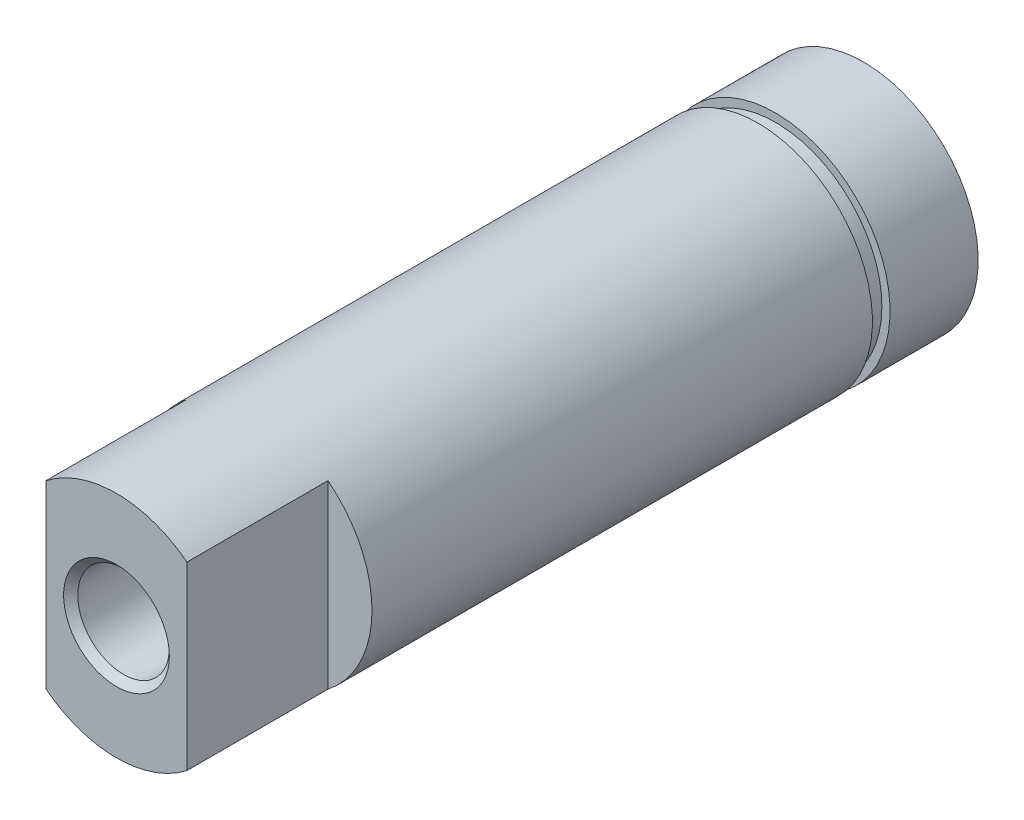
ISO-10303-21;
HEADER;
FILE_DESCRIPTION(('STEP AP214'),'2;1');
FILE_NAME('part.step','',(''),(''),'','','');
FILE_SCHEMA(('AUTOMOTIVE_DESIGN { 1 0 10303 214 1 1 1 1 }'));
ENDSEC;
DATA;
#1=APPLICATION_CONTEXT('core data for automotive mechanical design processes');
#2=APPLICATION_PROTOCOL_DEFINITION('international standard','automotive_design',2000,#1);
#3=PRODUCT_CONTEXT('',#1,'mechanical');
#4=PRODUCT('Part','Part','',(#3));
#5=PRODUCT_RELATED_PRODUCT_CATEGORY('part','',(#4));
#6=PRODUCT_DEFINITION_FORMATION('','',#4);
#7=PRODUCT_DEFINITION_CONTEXT('part definition',#1,'design');
#8=PRODUCT_DEFINITION('design','',#6,#7);
#9=PRODUCT_DEFINITION_SHAPE('','',#8);
#10=(LENGTH_UNIT() NAMED_UNIT(*) SI_UNIT(.MILLI.,.METRE.));
#11=(NAMED_UNIT(*) PLANE_ANGLE_UNIT() SI_UNIT($,.RADIAN.));
#12=(NAMED_UNIT(*) SI_UNIT($,.STERADIAN.) SOLID_ANGLE_UNIT());
#13=UNCERTAINTY_MEASURE_WITH_UNIT(LENGTH_MEASURE(1.E-05),#10,'distance_accuracy_value','');
#14=(GEOMETRIC_REPRESENTATION_CONTEXT(3) GLOBAL_UNCERTAINTY_ASSIGNED_CONTEXT((#13)) GLOBAL_UNIT_ASSIGNED_CONTEXT((#10,
#11,#12)) REPRESENTATION_CONTEXT('',''));
#15=CARTESIAN_POINT('',(0.,0.,0.));
#16=DIRECTION('',(0.,0.,1.));
#17=DIRECTION('',(1.,0.,0.));
#18=AXIS2_PLACEMENT_3D('',#15,#16,#17);
#19=CARTESIAN_POINT('',(0.,0.,6.2));
#20=DIRECTION('',(0.,0.,1.));
#21=DIRECTION('',(1.,0.,0.));
#22=AXIS2_PLACEMENT_3D('',#19,#20,#21);
#23=PLANE('',#22);
#24=CARTESIAN_POINT('',(0.,0.,6.2));
#25=DIRECTION('',(0.,0.,1.));
#26=DIRECTION('',(1.,0.,0.));
#27=AXIS2_PLACEMENT_3D('',#24,#25,#26);
#28=CIRCLE('',#27,1.3);
#29=CARTESIAN_POINT('',(1.3,0.,6.2));
#30=VERTEX_POINT('',#29);
#31=EDGE_CURVE('E19',#30,#30,#28,.F.);
#32=ORIENTED_EDGE('',*,*,#31,.F.);
#33=EDGE_LOOP('',(#32));
#34=FACE_BOUND('',#33,.T.);
#35=ADVANCED_FACE('F16',(#34),#23,.T.);
#36=CARTESIAN_POINT('',(0.,0.,6.2));
#37=DIRECTION('',(0.,0.,1.));
#38=DIRECTION('',(1.,0.,0.));
#39=AXIS2_PLACEMENT_3D('',#36,#37,#38);
#40=CYLINDRICAL_SURFACE('',#39,1.3);
#41=ORIENTED_EDGE('',*,*,#31,.T.);
#42=EDGE_LOOP('',(#41));
#43=FACE_BOUND('',#42,.T.);
#44=CARTESIAN_POINT('',(0.,0.,21.));
#45=DIRECTION('',(0.,0.,1.));
#46=DIRECTION('',(1.,0.,0.));
#47=AXIS2_PLACEMENT_3D('',#44,#45,#46);
#48=CIRCLE('',#47,1.3);
#49=CARTESIAN_POINT('',(1.3,0.,21.));
#50=VERTEX_POINT('',#49);
#51=EDGE_CURVE('E93',#50,#50,#48,.F.);
#52=ORIENTED_EDGE('',*,*,#51,.F.);
#53=EDGE_LOOP('',(#52));
#54=FACE_BOUND('',#53,.T.);
#55=ADVANCED_FACE('F232',(#43,#54),#40,.F.);
#56=CARTESIAN_POINT('',(0.,0.,21.));
#57=DIRECTION('',(0.,0.,1.));
#58=DIRECTION('',(1.,0.,0.));
#59=AXIS2_PLACEMENT_3D('',#56,#57,#58);
#60=CONICAL_SURFACE('',#59,1.3,0.785398163397451);
#61=ORIENTED_EDGE('',*,*,#51,.T.);
#62=EDGE_LOOP('',(#61));
#63=FACE_BOUND('',#62,.T.);
#64=CARTESIAN_POINT('',(0.,0.,21.2));
#65=DIRECTION('',(0.,0.,1.));
#66=DIRECTION('',(1.,0.,0.));
#67=AXIS2_PLACEMENT_3D('',#64,#65,#66);
#68=CIRCLE('',#67,1.5);
#69=CARTESIAN_POINT('',(1.5,0.,21.2));
#70=VERTEX_POINT('',#69);
#71=EDGE_CURVE('E62',#70,#70,#68,.F.);
#72=ORIENTED_EDGE('',*,*,#71,.F.);
#73=EDGE_LOOP('',(#72));
#74=FACE_BOUND('',#73,.T.);
#75=ADVANCED_FACE('F224',(#63,#74),#60,.F.);
#76=CARTESIAN_POINT('',(0.,0.,17.2));
#77=DIRECTION('',(0.,0.,-1.));
#78=DIRECTION('',(-1.,0.,0.));
#79=AXIS2_PLACEMENT_3D('',#76,#77,#78);
#80=PLANE('',#79);
#81=DIRECTION('',(0.,1.,0.));
#82=VECTOR('',#81,1.);
#83=CARTESIAN_POINT('',(2.,2.808702216,17.2));
#84=LINE('',#83,#82);
#85=CARTESIAN_POINT('',(2.00000000011882,-2.56173769139714,17.2));
#86=VERTEX_POINT('',#85);
#87=CARTESIAN_POINT('',(2.00000000011882,2.56173769139714,17.2));
#88=VERTEX_POINT('',#87);
#89=EDGE_CURVE('E78',#86,#88,#84,.T.);
#90=ORIENTED_EDGE('',*,*,#89,.F.);
#91=CARTESIAN_POINT('',(0.,0.,17.2));
#92=DIRECTION('',(0.,0.,-1.));
#93=DIRECTION('',(-1.,0.,0.));
#94=AXIS2_PLACEMENT_3D('',#91,#92,#93);
#95=CIRCLE('',#94,3.25);
#96=EDGE_CURVE('E71',#88,#86,#95,.T.);
#97=ORIENTED_EDGE('',*,*,#96,.F.);
#98=EDGE_LOOP('',(#90,#97));
#99=FACE_BOUND('',#98,.T.);
#100=ADVANCED_FACE('F113',(#99),#80,.F.);
#101=CARTESIAN_POINT('',(0.,0.,17.2));
#102=DIRECTION('',(0.,0.,-1.));
#103=DIRECTION('',(-1.,0.,0.));
#104=AXIS2_PLACEMENT_3D('',#101,#102,#103);
#105=PLANE('',#104);
#106=CARTESIAN_POINT('',(0.,0.,17.2));
#107=DIRECTION('',(0.,0.,-1.));
#108=DIRECTION('',(-1.,0.,0.));
#109=AXIS2_PLACEMENT_3D('',#106,#107,#108);
#110=CIRCLE('',#109,3.25);
#111=CARTESIAN_POINT('',(-2.00000000011882,-2.56173769139714,17.2));
#112=VERTEX_POINT('',#111);
#113=CARTESIAN_POINT('',(-2.00000000011882,2.56173769139714,17.2));
#114=VERTEX_POINT('',#113);
#115=EDGE_CURVE('E109',#112,#114,#110,.T.);
#116=ORIENTED_EDGE('',*,*,#115,.F.);
#117=DIRECTION('',(0.,1.,0.));
#118=VECTOR('',#117,1.);
#119=CARTESIAN_POINT('',(-2.,2.561737691,17.2));
#120=LINE('',#119,#118);
#121=EDGE_CURVE('E63',#114,#112,#120,.F.);
#122=ORIENTED_EDGE('',*,*,#121,.F.);
#123=EDGE_LOOP('',(#116,#122));
#124=FACE_BOUND('',#123,.T.);
#125=ADVANCED_FACE('F208',(#124),#105,.F.);
#126=CARTESIAN_POINT('',(-2.,2.561737691,17.2));
#127=DIRECTION('',(1.,0.,0.));
#128=DIRECTION('',(0.,0.,-1.));
#129=AXIS2_PLACEMENT_3D('',#126,#127,#128);
#130=PLANE('',#129);
#131=ORIENTED_EDGE('',*,*,#121,.T.);
#132=DIRECTION('',(0.,0.,-1.));
#133=VECTOR('',#132,1.);
#134=CARTESIAN_POINT('',(-2.00000000023763,-2.56173769130438,12.1));
#135=LINE('',#134,#133);
#136=CARTESIAN_POINT('',(-2.00000000011882,-2.56173769139714,21.2));
#137=VERTEX_POINT('',#136);
#138=EDGE_CURVE('E67',#137,#112,#135,.T.);
#139=ORIENTED_EDGE('',*,*,#138,.F.);
#140=DIRECTION('',(0.,1.,0.));
#141=VECTOR('',#140,1.);
#142=CARTESIAN_POINT('',(-2.,0.,21.2));
#143=LINE('',#142,#141);
#144=CARTESIAN_POINT('',(-2.00000000011882,2.56173769139714,21.2));
#145=VERTEX_POINT('',#144);
#146=EDGE_CURVE('E51',#145,#137,#143,.F.);
#147=ORIENTED_EDGE('',*,*,#146,.F.);
#148=DIRECTION('',(0.,0.,1.));
#149=VECTOR('',#148,1.);
#150=CARTESIAN_POINT('',(-2.00000000023763,2.56173769130438,12.1));
#151=LINE('',#150,#149);
#152=EDGE_CURVE('E108',#114,#145,#151,.T.);
#153=ORIENTED_EDGE('',*,*,#152,.F.);
#154=EDGE_LOOP('',(#131,#139,#147,#153));
#155=FACE_BOUND('',#154,.T.);
#156=ADVANCED_FACE('F68',(#155),#130,.F.);
#157=CARTESIAN_POINT('',(0.,0.,21.2));
#158=DIRECTION('',(0.,0.,1.));
#159=DIRECTION('',(1.,0.,0.));
#160=AXIS2_PLACEMENT_3D('',#157,#158,#159);
#161=PLANE('',#160);
#162=ORIENTED_EDGE('',*,*,#71,.T.);
#163=EDGE_LOOP('',(#162));
#164=FACE_BOUND('',#163,.T.);
#165=ORIENTED_EDGE('',*,*,#146,.T.);
#166=CARTESIAN_POINT('',(0.,0.,21.2));
#167=DIRECTION('',(0.,0.,-1.));
#168=DIRECTION('',(-1.,0.,0.));
#169=AXIS2_PLACEMENT_3D('',#166,#167,#168);
#170=CIRCLE('',#169,3.25);
#171=CARTESIAN_POINT('',(2.00000000011882,-2.56173769139714,21.2));
#172=VERTEX_POINT('',#171);
#173=EDGE_CURVE('E55',#172,#137,#170,.T.);
#174=ORIENTED_EDGE('',*,*,#173,.F.);
#175=DIRECTION('',(0.,1.,0.));
#176=VECTOR('',#175,1.);
#177=CARTESIAN_POINT('',(2.,2.808702216,21.2));
#178=LINE('',#177,#176);
#179=CARTESIAN_POINT('',(2.00000000011882,2.56173769139714,21.2));
#180=VERTEX_POINT('',#179);
#181=EDGE_CURVE('E34',#180,#172,#178,.F.);
#182=ORIENTED_EDGE('',*,*,#181,.F.);
#183=CARTESIAN_POINT('',(0.,0.,21.2));
#184=DIRECTION('',(0.,0.,-1.));
#185=DIRECTION('',(-1.,0.,0.));
#186=AXIS2_PLACEMENT_3D('',#183,#184,#185);
#187=CIRCLE('',#186,3.25);
#188=EDGE_CURVE('E58',#145,#180,#187,.T.);
#189=ORIENTED_EDGE('',*,*,#188,.F.);
#190=EDGE_LOOP('',(#165,#174,#182,#189));
#191=FACE_BOUND('',#190,.T.);
#192=ADVANCED_FACE('F53',(#164,#191),#161,.T.);
#193=CARTESIAN_POINT('',(2.,2.808702216,17.2));
#194=DIRECTION('',(-1.,0.,0.));
#195=DIRECTION('',(0.,0.,1.));
#196=AXIS2_PLACEMENT_3D('',#193,#194,#195);
#197=PLANE('',#196);
#198=ORIENTED_EDGE('',*,*,#89,.T.);
#199=DIRECTION('',(0.,0.,-1.));
#200=VECTOR('',#199,1.);
#201=CARTESIAN_POINT('',(2.00000000023763,2.56173769130438,12.1));
#202=LINE('',#201,#200);
#203=EDGE_CURVE('E91',#180,#88,#202,.T.);
#204=ORIENTED_EDGE('',*,*,#203,.F.);
#205=ORIENTED_EDGE('',*,*,#181,.T.);
#206=DIRECTION('',(0.,0.,1.));
#207=VECTOR('',#206,1.);
#208=CARTESIAN_POINT('',(2.00000000023763,-2.56173769130438,12.1));
#209=LINE('',#208,#207);
#210=EDGE_CURVE('E76',#86,#172,#209,.T.);
#211=ORIENTED_EDGE('',*,*,#210,.F.);
#212=EDGE_LOOP('',(#198,#204,#205,#211));
#213=FACE_BOUND('',#212,.T.);
#214=ADVANCED_FACE('F114',(#213),#197,.F.);
#215=CARTESIAN_POINT('',(0.,0.,3.));
#216=DIRECTION('',(0.,0.,-1.));
#217=DIRECTION('',(-1.,0.,0.));
#218=AXIS2_PLACEMENT_3D('',#215,#216,#217);
#219=CYLINDRICAL_SURFACE('',#218,3.25);
#220=CARTESIAN_POINT('',(0.,0.,3.));
#221=DIRECTION('',(0.,0.,-1.));
#222=DIRECTION('',(-1.,0.,0.));
#223=AXIS2_PLACEMENT_3D('',#220,#221,#222);
#224=CIRCLE('',#223,3.25);
#225=CARTESIAN_POINT('',(-3.25,0.,3.));
#226=VERTEX_POINT('',#225);
#227=EDGE_CURVE('E105',#226,#226,#224,.T.);
#228=ORIENTED_EDGE('',*,*,#227,.F.);
#229=EDGE_LOOP('',(#228));
#230=FACE_BOUND('',#229,.T.);
#231=ORIENTED_EDGE('',*,*,#188,.T.);
#232=ORIENTED_EDGE('',*,*,#203,.T.);
#233=ORIENTED_EDGE('',*,*,#96,.T.);
#234=ORIENTED_EDGE('',*,*,#210,.T.);
#235=ORIENTED_EDGE('',*,*,#173,.T.);
#236=ORIENTED_EDGE('',*,*,#138,.T.);
#237=ORIENTED_EDGE('',*,*,#115,.T.);
#238=ORIENTED_EDGE('',*,*,#152,.T.);
#239=EDGE_LOOP('',(#231,#232,#233,#234,#235,#236,#237,#238));
#240=FACE_BOUND('',#239,.T.);
#241=ADVANCED_FACE('F73',(#230,#240),#219,.T.);
#242=CARTESIAN_POINT('',(0.,3.25,3.));
#243=DIRECTION('',(0.,0.,-1.));
#244=DIRECTION('',(-1.,0.,0.));
#245=AXIS2_PLACEMENT_3D('',#242,#243,#244);
#246=PLANE('',#245);
#247=CARTESIAN_POINT('',(0.,0.,3.));
#248=DIRECTION('',(0.,0.,1.));
#249=DIRECTION('',(1.,0.,0.));
#250=AXIS2_PLACEMENT_3D('',#247,#248,#249);
#251=CIRCLE('',#250,3.018225213);
#252=CARTESIAN_POINT('',(3.018225213,0.,3.));
#253=VERTEX_POINT('',#252);
#254=EDGE_CURVE('E102',#253,#253,#251,.F.);
#255=ORIENTED_EDGE('',*,*,#254,.F.);
#256=EDGE_LOOP('',(#255));
#257=FACE_BOUND('',#256,.T.);
#258=ORIENTED_EDGE('',*,*,#227,.T.);
#259=EDGE_LOOP('',(#258));
#260=FACE_BOUND('',#259,.T.);
#261=ADVANCED_FACE('F122',(#257,#260),#246,.T.);
#262=CARTESIAN_POINT('',(0.,0.,3.));
#263=DIRECTION('',(0.,0.,1.));
#264=DIRECTION('',(1.,0.,0.));
#265=AXIS2_PLACEMENT_3D('',#262,#263,#264);
#266=CYLINDRICAL_SURFACE('',#265,3.018225213);
#267=CARTESIAN_POINT('',(0.,0.,2.5));
#268=DIRECTION('',(0.,0.,1.));
#269=DIRECTION('',(1.,0.,0.));
#270=AXIS2_PLACEMENT_3D('',#267,#268,#269);
#271=CIRCLE('',#270,3.018225213);
#272=CARTESIAN_POINT('',(3.018225213,0.,2.5));
#273=VERTEX_POINT('',#272);
#274=EDGE_CURVE('E99',#273,#273,#271,.F.);
#275=ORIENTED_EDGE('',*,*,#274,.F.);
#276=EDGE_LOOP('',(#275));
#277=FACE_BOUND('',#276,.T.);
#278=ORIENTED_EDGE('',*,*,#254,.T.);
#279=EDGE_LOOP('',(#278));
#280=FACE_BOUND('',#279,.T.);
#281=ADVANCED_FACE('F141',(#277,#280),#266,.T.);
#282=CARTESIAN_POINT('',(0.,3.25,2.5));
#283=DIRECTION('',(0.,0.,1.));
#284=DIRECTION('',(1.,0.,0.));
#285=AXIS2_PLACEMENT_3D('',#282,#283,#284);
#286=PLANE('',#285);
#287=ORIENTED_EDGE('',*,*,#274,.T.);
#288=EDGE_LOOP('',(#287));
#289=FACE_BOUND('',#288,.T.);
#290=CARTESIAN_POINT('',(0.,0.,2.5));
#291=DIRECTION('',(0.,0.,-1.));
#292=DIRECTION('',(-1.,0.,0.));
#293=AXIS2_PLACEMENT_3D('',#290,#291,#292);
#294=CIRCLE('',#293,3.25);
#295=CARTESIAN_POINT('',(-3.25,0.,2.5));
#296=VERTEX_POINT('',#295);
#297=EDGE_CURVE('E25',#296,#296,#294,.T.);
#298=ORIENTED_EDGE('',*,*,#297,.F.);
#299=EDGE_LOOP('',(#298));
#300=FACE_BOUND('',#299,.T.);
#301=ADVANCED_FACE('F134',(#289,#300),#286,.T.);
#302=CARTESIAN_POINT('',(0.,0.,0.));
#303=DIRECTION('',(0.,0.,1.));
#304=DIRECTION('',(1.,0.,0.));
#305=AXIS2_PLACEMENT_3D('',#302,#303,#304);
#306=PLANE('',#305);
#307=CARTESIAN_POINT('',(0.,0.,0.));
#308=DIRECTION('',(0.,0.,-1.));
#309=DIRECTION('',(-1.,0.,0.));
#310=AXIS2_PLACEMENT_3D('',#307,#308,#309);
#311=CIRCLE('',#310,3.25);
#312=CARTESIAN_POINT('',(-3.25,0.,0.));
#313=VERTEX_POINT('',#312);
#314=EDGE_CURVE('E11',#313,#313,#311,.F.);
#315=ORIENTED_EDGE('',*,*,#314,.F.);
#316=EDGE_LOOP('',(#315));
#317=FACE_BOUND('',#316,.T.);
#318=ADVANCED_FACE('F128',(#317),#306,.F.);
#319=CARTESIAN_POINT('',(0.,0.,0.));
#320=DIRECTION('',(0.,0.,-1.));
#321=DIRECTION('',(-1.,0.,0.));
#322=AXIS2_PLACEMENT_3D('',#319,#320,#321);
#323=CYLINDRICAL_SURFACE('',#322,3.25);
#324=ORIENTED_EDGE('',*,*,#314,.T.);
#325=EDGE_LOOP('',(#324));
#326=FACE_BOUND('',#325,.T.);
#327=ORIENTED_EDGE('',*,*,#297,.T.);
#328=EDGE_LOOP('',(#327));
#329=FACE_BOUND('',#328,.T.);
#330=ADVANCED_FACE('F126',(#326,#329),#323,.T.);
#331=CLOSED_SHELL('',(#35,#55,#75,#100,#125,#156,#192,#214,#241,#261,#281,#301,#318,#330));
#332=MANIFOLD_SOLID_BREP('B1',#331);
#333=ADVANCED_BREP_SHAPE_REPRESENTATION('',(#18,#332),#14);
#334=SHAPE_DEFINITION_REPRESENTATION(#9,#333);
ENDSEC;
END-ISO-10303-21;
